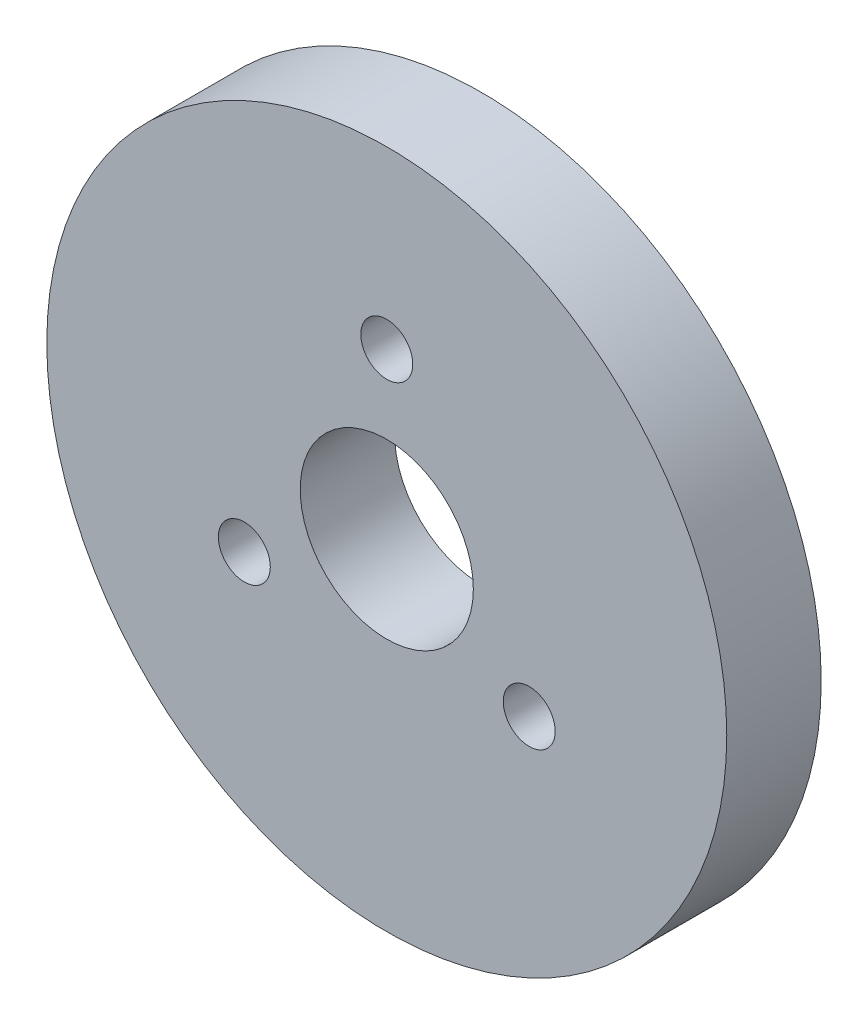
ISO-10303-21;
HEADER;
FILE_DESCRIPTION(('STEP AP214'),'2;1');
FILE_NAME('part.step','',(''),(''),'','','');
FILE_SCHEMA(('AUTOMOTIVE_DESIGN { 1 0 10303 214 1 1 1 1 }'));
ENDSEC;
DATA;
#1=APPLICATION_CONTEXT('core data for automotive mechanical design processes');
#2=APPLICATION_PROTOCOL_DEFINITION('international standard','automotive_design',2000,#1);
#3=PRODUCT_CONTEXT('',#1,'mechanical');
#4=PRODUCT('Part','Part','',(#3));
#5=PRODUCT_RELATED_PRODUCT_CATEGORY('part','',(#4));
#6=PRODUCT_DEFINITION_FORMATION('','',#4);
#7=PRODUCT_DEFINITION_CONTEXT('part definition',#1,'design');
#8=PRODUCT_DEFINITION('design','',#6,#7);
#9=PRODUCT_DEFINITION_SHAPE('','',#8);
#10=(LENGTH_UNIT() NAMED_UNIT(*) SI_UNIT(.MILLI.,.METRE.));
#11=(NAMED_UNIT(*) PLANE_ANGLE_UNIT() SI_UNIT($,.RADIAN.));
#12=(NAMED_UNIT(*) SI_UNIT($,.STERADIAN.) SOLID_ANGLE_UNIT());
#13=UNCERTAINTY_MEASURE_WITH_UNIT(LENGTH_MEASURE(1.E-05),#10,'distance_accuracy_value','');
#14=(GEOMETRIC_REPRESENTATION_CONTEXT(3) GLOBAL_UNCERTAINTY_ASSIGNED_CONTEXT((#13)) GLOBAL_UNIT_ASSIGNED_CONTEXT((#10,
#11,#12)) REPRESENTATION_CONTEXT('',''));
#15=CARTESIAN_POINT('',(0.,0.,0.));
#16=DIRECTION('',(0.,0.,1.));
#17=DIRECTION('',(1.,0.,0.));
#18=AXIS2_PLACEMENT_3D('',#15,#16,#17);
#19=CARTESIAN_POINT('',(0.,0.,6.));
#20=DIRECTION('',(0.,0.,1.));
#21=DIRECTION('',(1.,0.,0.));
#22=AXIS2_PLACEMENT_3D('',#19,#20,#21);
#23=PLANE('',#22);
#24=CARTESIAN_POINT('',(0.,10.45,6.));
#25=DIRECTION('',(0.,0.,1.));
#26=DIRECTION('',(1.,0.,0.));
#27=AXIS2_PLACEMENT_3D('',#24,#25,#26);
#28=CIRCLE('',#27,1.65);
#29=CARTESIAN_POINT('',(1.65,10.45,6.));
#30=VERTEX_POINT('',#29);
#31=EDGE_CURVE('E84',#30,#30,#28,.T.);
#32=ORIENTED_EDGE('',*,*,#31,.F.);
#33=EDGE_LOOP('',(#32));
#34=FACE_BOUND('',#33,.T.);
#35=CARTESIAN_POINT('',(9.04996546954796,-5.22499999999967,6.));
#36=DIRECTION('',(0.,0.,1.));
#37=DIRECTION('',(1.,0.,0.));
#38=AXIS2_PLACEMENT_3D('',#35,#36,#37);
#39=CIRCLE('',#38,1.65);
#40=CARTESIAN_POINT('',(10.699965469548,-5.22499999999967,6.));
#41=VERTEX_POINT('',#40);
#42=EDGE_CURVE('E80',#41,#41,#39,.T.);
#43=ORIENTED_EDGE('',*,*,#42,.F.);
#44=EDGE_LOOP('',(#43));
#45=FACE_BOUND('',#44,.T.);
#46=CARTESIAN_POINT('',(-9.04996546954681,-5.22500000000033,6.));
#47=DIRECTION('',(0.,0.,1.));
#48=DIRECTION('',(1.,0.,0.));
#49=AXIS2_PLACEMENT_3D('',#46,#47,#48);
#50=CIRCLE('',#49,1.65);
#51=CARTESIAN_POINT('',(-7.39996546954681,-5.22500000000033,6.));
#52=VERTEX_POINT('',#51);
#53=EDGE_CURVE('E72',#52,#52,#50,.T.);
#54=ORIENTED_EDGE('',*,*,#53,.F.);
#55=EDGE_LOOP('',(#54));
#56=FACE_BOUND('',#55,.T.);
#57=CARTESIAN_POINT('',(0.,0.,6.));
#58=DIRECTION('',(0.,0.,1.));
#59=DIRECTION('',(1.,0.,0.));
#60=AXIS2_PLACEMENT_3D('',#57,#58,#59);
#61=CIRCLE('',#60,21.6);
#62=CARTESIAN_POINT('',(21.6,0.,6.));
#63=VERTEX_POINT('',#62);
#64=EDGE_CURVE('E10',#63,#63,#61,.T.);
#65=ORIENTED_EDGE('',*,*,#64,.T.);
#66=EDGE_LOOP('',(#65));
#67=FACE_BOUND('',#66,.T.);
#68=CARTESIAN_POINT('',(0.,0.,6.));
#69=DIRECTION('',(0.,0.,1.));
#70=DIRECTION('',(1.,0.,0.));
#71=AXIS2_PLACEMENT_3D('',#68,#69,#70);
#72=CIRCLE('',#71,5.5);
#73=CARTESIAN_POINT('',(5.5,0.,6.));
#74=VERTEX_POINT('',#73);
#75=EDGE_CURVE('E58',#74,#74,#72,.T.);
#76=ORIENTED_EDGE('',*,*,#75,.F.);
#77=EDGE_LOOP('',(#76));
#78=FACE_BOUND('',#77,.T.);
#79=ADVANCED_FACE('F45',(#34,#45,#56,#67,#78),#23,.T.);
#80=CARTESIAN_POINT('',(0.,0.,0.));
#81=DIRECTION('',(0.,0.,1.));
#82=DIRECTION('',(1.,0.,0.));
#83=AXIS2_PLACEMENT_3D('',#80,#81,#82);
#84=PLANE('',#83);
#85=CARTESIAN_POINT('',(0.,10.45,0.));
#86=DIRECTION('',(0.,0.,1.));
#87=DIRECTION('',(1.,0.,0.));
#88=AXIS2_PLACEMENT_3D('',#85,#86,#87);
#89=CIRCLE('',#88,1.65);
#90=CARTESIAN_POINT('',(1.65,10.45,0.));
#91=VERTEX_POINT('',#90);
#92=EDGE_CURVE('E64',#91,#91,#89,.T.);
#93=ORIENTED_EDGE('',*,*,#92,.T.);
#94=EDGE_LOOP('',(#93));
#95=FACE_BOUND('',#94,.T.);
#96=CARTESIAN_POINT('',(9.04996546954796,-5.22499999999967,0.));
#97=DIRECTION('',(0.,0.,1.));
#98=DIRECTION('',(1.,0.,0.));
#99=AXIS2_PLACEMENT_3D('',#96,#97,#98);
#100=CIRCLE('',#99,1.65);
#101=CARTESIAN_POINT('',(10.699965469548,-5.22499999999967,0.));
#102=VERTEX_POINT('',#101);
#103=EDGE_CURVE('E76',#102,#102,#100,.T.);
#104=ORIENTED_EDGE('',*,*,#103,.T.);
#105=EDGE_LOOP('',(#104));
#106=FACE_BOUND('',#105,.T.);
#107=CARTESIAN_POINT('',(-9.04996546954681,-5.22500000000033,0.));
#108=DIRECTION('',(0.,0.,1.));
#109=DIRECTION('',(1.,0.,0.));
#110=AXIS2_PLACEMENT_3D('',#107,#108,#109);
#111=CIRCLE('',#110,1.65);
#112=CARTESIAN_POINT('',(-7.39996546954681,-5.22500000000033,0.));
#113=VERTEX_POINT('',#112);
#114=EDGE_CURVE('E68',#113,#113,#111,.T.);
#115=ORIENTED_EDGE('',*,*,#114,.T.);
#116=EDGE_LOOP('',(#115));
#117=FACE_BOUND('',#116,.T.);
#118=CARTESIAN_POINT('',(0.,0.,0.));
#119=DIRECTION('',(0.,0.,1.));
#120=DIRECTION('',(1.,0.,0.));
#121=AXIS2_PLACEMENT_3D('',#118,#119,#120);
#122=CIRCLE('',#121,21.6);
#123=CARTESIAN_POINT('',(21.6,0.,0.));
#124=VERTEX_POINT('',#123);
#125=EDGE_CURVE('E49',#124,#124,#122,.T.);
#126=ORIENTED_EDGE('',*,*,#125,.F.);
#127=EDGE_LOOP('',(#126));
#128=FACE_BOUND('',#127,.T.);
#129=CARTESIAN_POINT('',(0.,0.,0.));
#130=DIRECTION('',(0.,0.,1.));
#131=DIRECTION('',(1.,0.,0.));
#132=AXIS2_PLACEMENT_3D('',#129,#130,#131);
#133=CIRCLE('',#132,5.5);
#134=CARTESIAN_POINT('',(5.5,0.,0.));
#135=VERTEX_POINT('',#134);
#136=EDGE_CURVE('E60',#135,#135,#133,.T.);
#137=ORIENTED_EDGE('',*,*,#136,.T.);
#138=EDGE_LOOP('',(#137));
#139=FACE_BOUND('',#138,.T.);
#140=ADVANCED_FACE('F92',(#95,#106,#117,#128,#139),#84,.F.);
#141=CARTESIAN_POINT('',(0.,0.,6.));
#142=DIRECTION('',(0.,0.,-1.));
#143=DIRECTION('',(-1.,0.,0.));
#144=AXIS2_PLACEMENT_3D('',#141,#142,#143);
#145=CYLINDRICAL_SURFACE('',#144,21.6);
#146=ORIENTED_EDGE('',*,*,#64,.F.);
#147=EDGE_LOOP('',(#146));
#148=FACE_BOUND('',#147,.T.);
#149=ORIENTED_EDGE('',*,*,#125,.T.);
#150=EDGE_LOOP('',(#149));
#151=FACE_BOUND('',#150,.T.);
#152=ADVANCED_FACE('F47',(#148,#151),#145,.T.);
#153=CARTESIAN_POINT('',(0.,0.,6.));
#154=DIRECTION('',(0.,0.,-1.));
#155=DIRECTION('',(-1.,0.,0.));
#156=AXIS2_PLACEMENT_3D('',#153,#154,#155);
#157=CYLINDRICAL_SURFACE('',#156,5.5);
#158=ORIENTED_EDGE('',*,*,#75,.T.);
#159=EDGE_LOOP('',(#158));
#160=FACE_BOUND('',#159,.T.);
#161=ORIENTED_EDGE('',*,*,#136,.F.);
#162=EDGE_LOOP('',(#161));
#163=FACE_BOUND('',#162,.T.);
#164=ADVANCED_FACE('F111',(#160,#163),#157,.F.);
#165=CARTESIAN_POINT('',(-9.04996546954681,-5.22500000000033,0.));
#166=DIRECTION('',(0.,0.,1.));
#167=DIRECTION('',(1.,0.,0.));
#168=AXIS2_PLACEMENT_3D('',#165,#166,#167);
#169=CYLINDRICAL_SURFACE('',#168,1.65);
#170=ORIENTED_EDGE('',*,*,#114,.F.);
#171=EDGE_LOOP('',(#170));
#172=FACE_BOUND('',#171,.T.);
#173=ORIENTED_EDGE('',*,*,#53,.T.);
#174=EDGE_LOOP('',(#173));
#175=FACE_BOUND('',#174,.T.);
#176=ADVANCED_FACE('F114',(#172,#175),#169,.F.);
#177=CARTESIAN_POINT('',(9.04996546954796,-5.22499999999967,0.));
#178=DIRECTION('',(0.,0.,1.));
#179=DIRECTION('',(1.,0.,0.));
#180=AXIS2_PLACEMENT_3D('',#177,#178,#179);
#181=CYLINDRICAL_SURFACE('',#180,1.65);
#182=ORIENTED_EDGE('',*,*,#103,.F.);
#183=EDGE_LOOP('',(#182));
#184=FACE_BOUND('',#183,.T.);
#185=ORIENTED_EDGE('',*,*,#42,.T.);
#186=EDGE_LOOP('',(#185));
#187=FACE_BOUND('',#186,.T.);
#188=ADVANCED_FACE('F98',(#184,#187),#181,.F.);
#189=CARTESIAN_POINT('',(0.,10.45,0.));
#190=DIRECTION('',(0.,0.,1.));
#191=DIRECTION('',(1.,0.,0.));
#192=AXIS2_PLACEMENT_3D('',#189,#190,#191);
#193=CYLINDRICAL_SURFACE('',#192,1.65);
#194=ORIENTED_EDGE('',*,*,#92,.F.);
#195=EDGE_LOOP('',(#194));
#196=FACE_BOUND('',#195,.T.);
#197=ORIENTED_EDGE('',*,*,#31,.T.);
#198=EDGE_LOOP('',(#197));
#199=FACE_BOUND('',#198,.T.);
#200=ADVANCED_FACE('F95',(#196,#199),#193,.F.);
#201=CLOSED_SHELL('',(#79,#140,#152,#164,#176,#188,#200));
#202=MANIFOLD_SOLID_BREP('B2',#201);
#203=ADVANCED_BREP_SHAPE_REPRESENTATION('',(#18,#202),#14);
#204=SHAPE_DEFINITION_REPRESENTATION(#9,#203);
ENDSEC;
END-ISO-10303-21;
